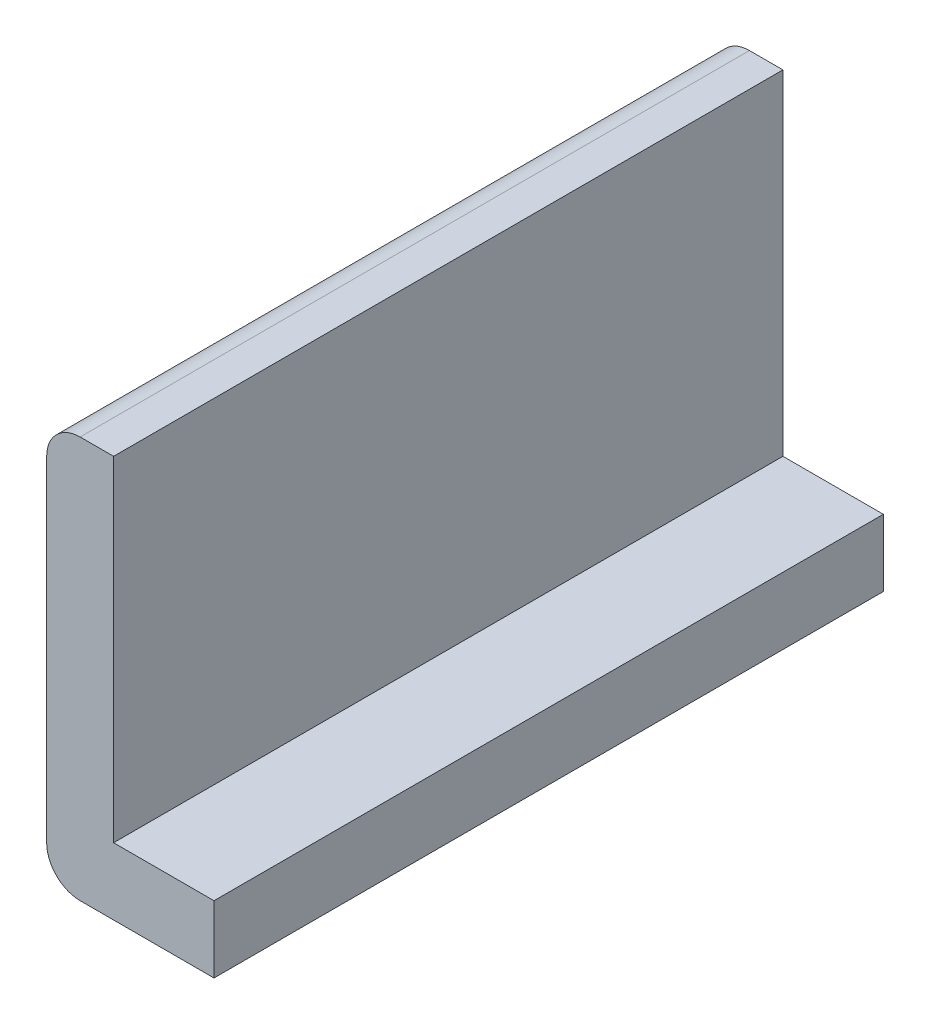
ISO-10303-21;
HEADER;
FILE_DESCRIPTION(('STEP AP214'),'2;1');
FILE_NAME('part.step','',(''),(''),'','','');
FILE_SCHEMA(('AUTOMOTIVE_DESIGN { 1 0 10303 214 1 1 1 1 }'));
ENDSEC;
DATA;
#1=APPLICATION_CONTEXT('core data for automotive mechanical design processes');
#2=APPLICATION_PROTOCOL_DEFINITION('international standard','automotive_design',2000,#1);
#3=PRODUCT_CONTEXT('',#1,'mechanical');
#4=PRODUCT('Part','Part','',(#3));
#5=PRODUCT_RELATED_PRODUCT_CATEGORY('part','',(#4));
#6=PRODUCT_DEFINITION_FORMATION('','',#4);
#7=PRODUCT_DEFINITION_CONTEXT('part definition',#1,'design');
#8=PRODUCT_DEFINITION('design','',#6,#7);
#9=PRODUCT_DEFINITION_SHAPE('','',#8);
#10=(LENGTH_UNIT() NAMED_UNIT(*) SI_UNIT(.MILLI.,.METRE.));
#11=(NAMED_UNIT(*) PLANE_ANGLE_UNIT() SI_UNIT($,.RADIAN.));
#12=(NAMED_UNIT(*) SI_UNIT($,.STERADIAN.) SOLID_ANGLE_UNIT());
#13=UNCERTAINTY_MEASURE_WITH_UNIT(LENGTH_MEASURE(1.E-05),#10,'distance_accuracy_value','');
#14=(GEOMETRIC_REPRESENTATION_CONTEXT(3) GLOBAL_UNCERTAINTY_ASSIGNED_CONTEXT((#13)) GLOBAL_UNIT_ASSIGNED_CONTEXT((#10,
#11,#12)) REPRESENTATION_CONTEXT('',''));
#15=CARTESIAN_POINT('',(0.,0.,0.));
#16=DIRECTION('',(0.,0.,1.));
#17=DIRECTION('',(1.,0.,0.));
#18=AXIS2_PLACEMENT_3D('',#15,#16,#17);
#19=CARTESIAN_POINT('',(0.1,1.1,2.));
#20=DIRECTION('',(0.,0.,-1.));
#21=DIRECTION('',(-1.,0.,0.));
#22=AXIS2_PLACEMENT_3D('',#19,#20,#21);
#23=CYLINDRICAL_SURFACE('',#22,0.1);
#24=CARTESIAN_POINT('',(0.1,1.1,0.));
#25=DIRECTION('',(0.,0.,1.));
#26=DIRECTION('',(-1.,0.,0.));
#27=AXIS2_PLACEMENT_3D('',#24,#25,#26);
#28=CIRCLE('',#27,0.1);
#29=CARTESIAN_POINT('',(0.100000000000001,1.2,0.));
#30=VERTEX_POINT('',#29);
#31=CARTESIAN_POINT('',(0.,1.1,0.));
#32=VERTEX_POINT('',#31);
#33=EDGE_CURVE('E98',#30,#32,#28,.T.);
#34=ORIENTED_EDGE('',*,*,#33,.T.);
#35=DIRECTION('',(0.,0.,-1.));
#36=VECTOR('',#35,1.);
#37=CARTESIAN_POINT('',(0.,1.1,2.));
#38=LINE('',#37,#36);
#39=CARTESIAN_POINT('',(0.,1.1,2.));
#40=VERTEX_POINT('',#39);
#41=EDGE_CURVE('E11',#40,#32,#38,.T.);
#42=ORIENTED_EDGE('',*,*,#41,.F.);
#43=CARTESIAN_POINT('',(0.1,1.1,2.));
#44=DIRECTION('',(0.,0.,1.));
#45=DIRECTION('',(-1.,0.,0.));
#46=AXIS2_PLACEMENT_3D('',#43,#44,#45);
#47=CIRCLE('',#46,0.1);
#48=CARTESIAN_POINT('',(0.100000000000001,1.2,2.));
#49=VERTEX_POINT('',#48);
#50=EDGE_CURVE('E125',#49,#40,#47,.T.);
#51=ORIENTED_EDGE('',*,*,#50,.F.);
#52=DIRECTION('',(0.,0.,-1.));
#53=VECTOR('',#52,1.);
#54=CARTESIAN_POINT('',(0.100000000000001,1.2,2.));
#55=LINE('',#54,#53);
#56=EDGE_CURVE('E111',#49,#30,#55,.T.);
#57=ORIENTED_EDGE('',*,*,#56,.T.);
#58=EDGE_LOOP('',(#34,#42,#51,#57));
#59=FACE_BOUND('',#58,.T.);
#60=ADVANCED_FACE('F30',(#59),#23,.T.);
#61=CARTESIAN_POINT('',(0.,0.100000000000001,2.));
#62=DIRECTION('',(1.,0.,0.));
#63=DIRECTION('',(0.,0.,-1.));
#64=AXIS2_PLACEMENT_3D('',#61,#62,#63);
#65=PLANE('',#64);
#66=DIRECTION('',(0.,-1.,0.));
#67=VECTOR('',#66,1.);
#68=CARTESIAN_POINT('',(0.,0.100000000000001,0.));
#69=LINE('',#68,#67);
#70=CARTESIAN_POINT('',(0.,0.100000000000001,0.));
#71=VERTEX_POINT('',#70);
#72=EDGE_CURVE('E94',#32,#71,#69,.T.);
#73=ORIENTED_EDGE('',*,*,#72,.T.);
#74=DIRECTION('',(0.,0.,-1.));
#75=VECTOR('',#74,1.);
#76=CARTESIAN_POINT('',(0.,0.100000000000001,2.));
#77=LINE('',#76,#75);
#78=CARTESIAN_POINT('',(0.,0.100000000000001,2.));
#79=VERTEX_POINT('',#78);
#80=EDGE_CURVE('E37',#79,#71,#77,.T.);
#81=ORIENTED_EDGE('',*,*,#80,.F.);
#82=DIRECTION('',(0.,-1.,0.));
#83=VECTOR('',#82,1.);
#84=CARTESIAN_POINT('',(0.,0.100000000000001,2.));
#85=LINE('',#84,#83);
#86=EDGE_CURVE('E107',#40,#79,#85,.T.);
#87=ORIENTED_EDGE('',*,*,#86,.F.);
#88=ORIENTED_EDGE('',*,*,#41,.T.);
#89=EDGE_LOOP('',(#73,#81,#87,#88));
#90=FACE_BOUND('',#89,.T.);
#91=ADVANCED_FACE('F106',(#90),#65,.F.);
#92=CARTESIAN_POINT('',(0.1,0.1,2.));
#93=DIRECTION('',(0.,0.,-1.));
#94=DIRECTION('',(-1.,0.,0.));
#95=AXIS2_PLACEMENT_3D('',#92,#93,#94);
#96=CYLINDRICAL_SURFACE('',#95,0.1);
#97=CARTESIAN_POINT('',(0.1,0.1,0.));
#98=DIRECTION('',(0.,0.,1.));
#99=DIRECTION('',(-1.,0.,0.));
#100=AXIS2_PLACEMENT_3D('',#97,#98,#99);
#101=CIRCLE('',#100,0.1);
#102=CARTESIAN_POINT('',(0.100000000000001,0.,0.));
#103=VERTEX_POINT('',#102);
#104=EDGE_CURVE('E100',#71,#103,#101,.T.);
#105=ORIENTED_EDGE('',*,*,#104,.T.);
#106=DIRECTION('',(0.,0.,-1.));
#107=VECTOR('',#106,1.);
#108=CARTESIAN_POINT('',(0.100000000000001,0.,2.));
#109=LINE('',#108,#107);
#110=CARTESIAN_POINT('',(0.100000000000001,0.,2.));
#111=VERTEX_POINT('',#110);
#112=EDGE_CURVE('E151',#111,#103,#109,.T.);
#113=ORIENTED_EDGE('',*,*,#112,.F.);
#114=CARTESIAN_POINT('',(0.1,0.1,2.));
#115=DIRECTION('',(0.,0.,1.));
#116=DIRECTION('',(-1.,0.,0.));
#117=AXIS2_PLACEMENT_3D('',#114,#115,#116);
#118=CIRCLE('',#117,0.1);
#119=EDGE_CURVE('E128',#79,#111,#118,.T.);
#120=ORIENTED_EDGE('',*,*,#119,.F.);
#121=ORIENTED_EDGE('',*,*,#80,.T.);
#122=EDGE_LOOP('',(#105,#113,#120,#121));
#123=FACE_BOUND('',#122,.T.);
#124=ADVANCED_FACE('F155',(#123),#96,.T.);
#125=CARTESIAN_POINT('',(0.100000000000001,0.,2.));
#126=DIRECTION('',(0.,1.,0.));
#127=DIRECTION('',(0.,0.,1.));
#128=AXIS2_PLACEMENT_3D('',#125,#126,#127);
#129=PLANE('',#128);
#130=DIRECTION('',(1.,0.,0.));
#131=VECTOR('',#130,1.);
#132=CARTESIAN_POINT('',(0.100000000000001,0.,0.));
#133=LINE('',#132,#131);
#134=CARTESIAN_POINT('',(0.5,0.,0.));
#135=VERTEX_POINT('',#134);
#136=EDGE_CURVE('E115',#103,#135,#133,.T.);
#137=ORIENTED_EDGE('',*,*,#136,.T.);
#138=DIRECTION('',(0.,0.,-1.));
#139=VECTOR('',#138,1.);
#140=CARTESIAN_POINT('',(0.5,0.,2.));
#141=LINE('',#140,#139);
#142=CARTESIAN_POINT('',(0.5,0.,2.));
#143=VERTEX_POINT('',#142);
#144=EDGE_CURVE('E148',#143,#135,#141,.T.);
#145=ORIENTED_EDGE('',*,*,#144,.F.);
#146=DIRECTION('',(1.,0.,0.));
#147=VECTOR('',#146,1.);
#148=CARTESIAN_POINT('',(0.100000000000001,0.,2.));
#149=LINE('',#148,#147);
#150=EDGE_CURVE('E130',#111,#143,#149,.T.);
#151=ORIENTED_EDGE('',*,*,#150,.F.);
#152=ORIENTED_EDGE('',*,*,#112,.T.);
#153=EDGE_LOOP('',(#137,#145,#151,#152));
#154=FACE_BOUND('',#153,.T.);
#155=ADVANCED_FACE('F163',(#154),#129,.F.);
#156=CARTESIAN_POINT('',(0.5,0.2,2.));
#157=DIRECTION('',(-1.,0.,0.));
#158=DIRECTION('',(0.,0.,1.));
#159=AXIS2_PLACEMENT_3D('',#156,#157,#158);
#160=PLANE('',#159);
#161=DIRECTION('',(0.,1.,0.));
#162=VECTOR('',#161,1.);
#163=CARTESIAN_POINT('',(0.5,0.2,0.));
#164=LINE('',#163,#162);
#165=CARTESIAN_POINT('',(0.5,0.2,0.));
#166=VERTEX_POINT('',#165);
#167=EDGE_CURVE('E117',#135,#166,#164,.T.);
#168=ORIENTED_EDGE('',*,*,#167,.T.);
#169=DIRECTION('',(0.,0.,-1.));
#170=VECTOR('',#169,1.);
#171=CARTESIAN_POINT('',(0.5,0.2,2.));
#172=LINE('',#171,#170);
#173=CARTESIAN_POINT('',(0.5,0.2,2.));
#174=VERTEX_POINT('',#173);
#175=EDGE_CURVE('E145',#174,#166,#172,.T.);
#176=ORIENTED_EDGE('',*,*,#175,.F.);
#177=DIRECTION('',(0.,1.,0.));
#178=VECTOR('',#177,1.);
#179=CARTESIAN_POINT('',(0.5,0.2,2.));
#180=LINE('',#179,#178);
#181=EDGE_CURVE('E132',#143,#174,#180,.T.);
#182=ORIENTED_EDGE('',*,*,#181,.F.);
#183=ORIENTED_EDGE('',*,*,#144,.T.);
#184=EDGE_LOOP('',(#168,#176,#182,#183));
#185=FACE_BOUND('',#184,.T.);
#186=ADVANCED_FACE('F166',(#185),#160,.F.);
#187=CARTESIAN_POINT('',(0.2,0.2,2.));
#188=DIRECTION('',(0.,-1.,0.));
#189=DIRECTION('',(0.,0.,-1.));
#190=AXIS2_PLACEMENT_3D('',#187,#188,#189);
#191=PLANE('',#190);
#192=DIRECTION('',(-1.,0.,0.));
#193=VECTOR('',#192,1.);
#194=CARTESIAN_POINT('',(0.2,0.2,0.));
#195=LINE('',#194,#193);
#196=CARTESIAN_POINT('',(0.2,0.2,0.));
#197=VERTEX_POINT('',#196);
#198=EDGE_CURVE('E119',#166,#197,#195,.T.);
#199=ORIENTED_EDGE('',*,*,#198,.T.);
#200=DIRECTION('',(0.,0.,-1.));
#201=VECTOR('',#200,1.);
#202=CARTESIAN_POINT('',(0.2,0.2,2.));
#203=LINE('',#202,#201);
#204=CARTESIAN_POINT('',(0.2,0.2,2.));
#205=VERTEX_POINT('',#204);
#206=EDGE_CURVE('E142',#205,#197,#203,.T.);
#207=ORIENTED_EDGE('',*,*,#206,.F.);
#208=DIRECTION('',(-1.,0.,0.));
#209=VECTOR('',#208,1.);
#210=CARTESIAN_POINT('',(0.2,0.2,2.));
#211=LINE('',#210,#209);
#212=EDGE_CURVE('E134',#174,#205,#211,.T.);
#213=ORIENTED_EDGE('',*,*,#212,.F.);
#214=ORIENTED_EDGE('',*,*,#175,.T.);
#215=EDGE_LOOP('',(#199,#207,#213,#214));
#216=FACE_BOUND('',#215,.T.);
#217=ADVANCED_FACE('F171',(#216),#191,.F.);
#218=CARTESIAN_POINT('',(0.2,0.2,2.));
#219=DIRECTION('',(-1.,0.,0.));
#220=DIRECTION('',(0.,0.,1.));
#221=AXIS2_PLACEMENT_3D('',#218,#219,#220);
#222=PLANE('',#221);
#223=DIRECTION('',(0.,1.,0.));
#224=VECTOR('',#223,1.);
#225=CARTESIAN_POINT('',(0.2,0.2,0.));
#226=LINE('',#225,#224);
#227=CARTESIAN_POINT('',(0.2,1.2,0.));
#228=VERTEX_POINT('',#227);
#229=EDGE_CURVE('E121',#197,#228,#226,.T.);
#230=ORIENTED_EDGE('',*,*,#229,.T.);
#231=DIRECTION('',(0.,0.,-1.));
#232=VECTOR('',#231,1.);
#233=CARTESIAN_POINT('',(0.2,1.2,2.));
#234=LINE('',#233,#232);
#235=CARTESIAN_POINT('',(0.2,1.2,2.));
#236=VERTEX_POINT('',#235);
#237=EDGE_CURVE('E139',#236,#228,#234,.T.);
#238=ORIENTED_EDGE('',*,*,#237,.F.);
#239=DIRECTION('',(0.,1.,0.));
#240=VECTOR('',#239,1.);
#241=CARTESIAN_POINT('',(0.2,0.2,2.));
#242=LINE('',#241,#240);
#243=EDGE_CURVE('E49',#205,#236,#242,.T.);
#244=ORIENTED_EDGE('',*,*,#243,.F.);
#245=ORIENTED_EDGE('',*,*,#206,.T.);
#246=EDGE_LOOP('',(#230,#238,#244,#245));
#247=FACE_BOUND('',#246,.T.);
#248=ADVANCED_FACE('F174',(#247),#222,.F.);
#249=CARTESIAN_POINT('',(0.100000000000001,1.2,2.));
#250=DIRECTION('',(0.,-1.,0.));
#251=DIRECTION('',(0.,0.,-1.));
#252=AXIS2_PLACEMENT_3D('',#249,#250,#251);
#253=PLANE('',#252);
#254=DIRECTION('',(-1.,0.,0.));
#255=VECTOR('',#254,1.);
#256=CARTESIAN_POINT('',(0.100000000000001,1.2,0.));
#257=LINE('',#256,#255);
#258=EDGE_CURVE('E123',#228,#30,#257,.T.);
#259=ORIENTED_EDGE('',*,*,#258,.T.);
#260=ORIENTED_EDGE('',*,*,#56,.F.);
#261=DIRECTION('',(-1.,0.,0.));
#262=VECTOR('',#261,1.);
#263=CARTESIAN_POINT('',(0.100000000000001,1.2,2.));
#264=LINE('',#263,#262);
#265=EDGE_CURVE('E44',#236,#49,#264,.T.);
#266=ORIENTED_EDGE('',*,*,#265,.F.);
#267=ORIENTED_EDGE('',*,*,#237,.T.);
#268=EDGE_LOOP('',(#259,#260,#266,#267));
#269=FACE_BOUND('',#268,.T.);
#270=ADVANCED_FACE('F176',(#269),#253,.F.);
#271=CARTESIAN_POINT('',(0.1,1.1,2.));
#272=DIRECTION('',(0.,0.,-1.));
#273=DIRECTION('',(-1.,0.,0.));
#274=AXIS2_PLACEMENT_3D('',#271,#272,#273);
#275=PLANE('',#274);
#276=ORIENTED_EDGE('',*,*,#50,.T.);
#277=ORIENTED_EDGE('',*,*,#86,.T.);
#278=ORIENTED_EDGE('',*,*,#119,.T.);
#279=ORIENTED_EDGE('',*,*,#150,.T.);
#280=ORIENTED_EDGE('',*,*,#181,.T.);
#281=ORIENTED_EDGE('',*,*,#212,.T.);
#282=ORIENTED_EDGE('',*,*,#243,.T.);
#283=ORIENTED_EDGE('',*,*,#265,.T.);
#284=EDGE_LOOP('',(#276,#277,#278,#279,#280,#281,#282,#283));
#285=FACE_BOUND('',#284,.T.);
#286=ADVANCED_FACE('F158',(#285),#275,.F.);
#287=CARTESIAN_POINT('',(0.1,1.1,0.));
#288=DIRECTION('',(0.,0.,-1.));
#289=DIRECTION('',(-1.,0.,0.));
#290=AXIS2_PLACEMENT_3D('',#287,#288,#289);
#291=PLANE('',#290);
#292=ORIENTED_EDGE('',*,*,#33,.F.);
#293=ORIENTED_EDGE('',*,*,#258,.F.);
#294=ORIENTED_EDGE('',*,*,#229,.F.);
#295=ORIENTED_EDGE('',*,*,#198,.F.);
#296=ORIENTED_EDGE('',*,*,#167,.F.);
#297=ORIENTED_EDGE('',*,*,#136,.F.);
#298=ORIENTED_EDGE('',*,*,#104,.F.);
#299=ORIENTED_EDGE('',*,*,#72,.F.);
#300=EDGE_LOOP('',(#292,#293,#294,#295,#296,#297,#298,#299));
#301=FACE_BOUND('',#300,.T.);
#302=ADVANCED_FACE('F95',(#301),#291,.T.);
#303=CLOSED_SHELL('',(#60,#91,#124,#155,#186,#217,#248,#270,#286,#302));
#304=MANIFOLD_SOLID_BREP('B2',#303);
#305=ADVANCED_BREP_SHAPE_REPRESENTATION('',(#18,#304),#14);
#306=SHAPE_DEFINITION_REPRESENTATION(#9,#305);
ENDSEC;
END-ISO-10303-21;
